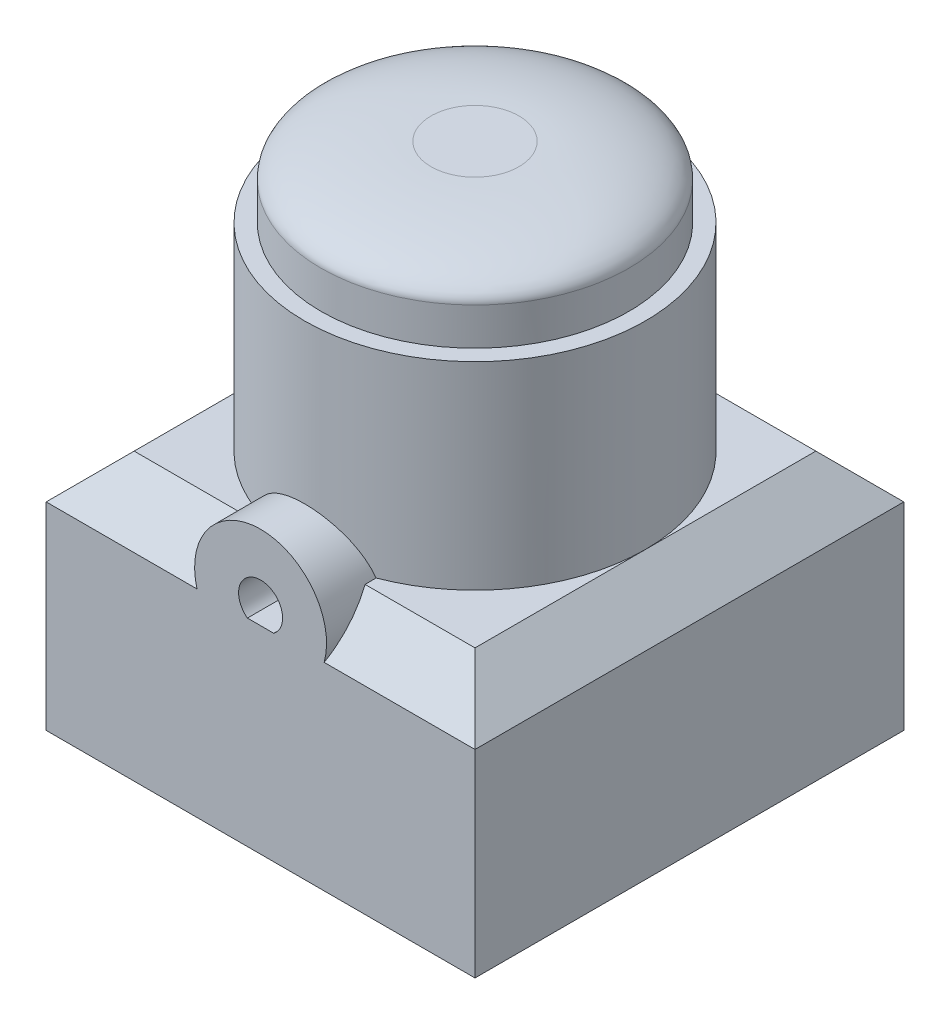
ISO-10303-21;
HEADER;
FILE_DESCRIPTION(('STEP AP214'),'2;1');
FILE_NAME('part.step','',(''),(''),'','','');
FILE_SCHEMA(('AUTOMOTIVE_DESIGN { 1 0 10303 214 1 1 1 1 }'));
ENDSEC;
DATA;
#1=APPLICATION_CONTEXT('core data for automotive mechanical design processes');
#2=APPLICATION_PROTOCOL_DEFINITION('international standard','automotive_design',2000,#1);
#3=PRODUCT_CONTEXT('',#1,'mechanical');
#4=PRODUCT('Part','Part','',(#3));
#5=PRODUCT_RELATED_PRODUCT_CATEGORY('part','',(#4));
#6=PRODUCT_DEFINITION_FORMATION('','',#4);
#7=PRODUCT_DEFINITION_CONTEXT('part definition',#1,'design');
#8=PRODUCT_DEFINITION('design','',#6,#7);
#9=PRODUCT_DEFINITION_SHAPE('','',#8);
#10=(LENGTH_UNIT() NAMED_UNIT(*) SI_UNIT(.MILLI.,.METRE.));
#11=(NAMED_UNIT(*) PLANE_ANGLE_UNIT() SI_UNIT($,.RADIAN.));
#12=(NAMED_UNIT(*) SI_UNIT($,.STERADIAN.) SOLID_ANGLE_UNIT());
#13=UNCERTAINTY_MEASURE_WITH_UNIT(LENGTH_MEASURE(1.E-05),#10,'distance_accuracy_value','');
#14=(GEOMETRIC_REPRESENTATION_CONTEXT(3) GLOBAL_UNCERTAINTY_ASSIGNED_CONTEXT((#13)) GLOBAL_UNIT_ASSIGNED_CONTEXT((#10,
#11,#12)) REPRESENTATION_CONTEXT('',''));
#15=CARTESIAN_POINT('',(0.,0.,0.));
#16=DIRECTION('',(0.,0.,1.));
#17=DIRECTION('',(1.,0.,0.));
#18=AXIS2_PLACEMENT_3D('',#15,#16,#17);
#19=CARTESIAN_POINT('',(0.,11.,7.75));
#20=DIRECTION('',(0.,-0.707106781186546,-0.707106781186549));
#21=DIRECTION('',(1.,0.,0.));
#22=AXIS2_PLACEMENT_3D('',#19,#20,#21);
#23=PLANE('',#22);
#24=CARTESIAN_POINT('',(0.,9.8,8.94999999999999));
#25=DIRECTION('',(0.,-0.707106781186546,-0.707106781186549));
#26=DIRECTION('',(0.,-0.707106781186549,0.707106781186546));
#27=AXIS2_PLACEMENT_3D('',#24,#25,#26);
#28=ELLIPSE('',#27,4.24264068711928,3.);
#29=CARTESIAN_POINT('',(2.7495454169735,11.,7.75));
#30=VERTEX_POINT('',#29);
#31=CARTESIAN_POINT('',(2.89136645896019,8.99999999999999,9.75));
#32=VERTEX_POINT('',#31);
#33=EDGE_CURVE('E295',#30,#32,#28,.T.);
#34=ORIENTED_EDGE('',*,*,#33,.T.);
#35=DIRECTION('',(-1.,0.,0.));
#36=VECTOR('',#35,1.);
#37=CARTESIAN_POINT('',(-9.75,8.99999999999999,9.75));
#38=LINE('',#37,#36);
#39=CARTESIAN_POINT('',(9.75,8.99999999999999,9.75));
#40=VERTEX_POINT('',#39);
#41=EDGE_CURVE('E12',#40,#32,#38,.T.);
#42=ORIENTED_EDGE('',*,*,#41,.F.);
#43=DIRECTION('',(-0.577350269189625,0.577350269189627,-0.577350269189625));
#44=VECTOR('',#43,1.);
#45=CARTESIAN_POINT('',(5.16666666666667,13.5833333333333,5.16666666666667));
#46=LINE('',#45,#44);
#47=CARTESIAN_POINT('',(7.75,11.,7.75));
#48=VERTEX_POINT('',#47);
#49=EDGE_CURVE('E294',#48,#40,#46,.F.);
#50=ORIENTED_EDGE('',*,*,#49,.F.);
#51=DIRECTION('',(1.,0.,0.));
#52=VECTOR('',#51,1.);
#53=CARTESIAN_POINT('',(0.,11.,7.75));
#54=LINE('',#53,#52);
#55=EDGE_CURVE('E262',#30,#48,#54,.T.);
#56=ORIENTED_EDGE('',*,*,#55,.F.);
#57=EDGE_LOOP('',(#34,#42,#50,#56));
#58=FACE_BOUND('',#57,.T.);
#59=ADVANCED_FACE('F38',(#58),#23,.F.);
#60=CARTESIAN_POINT('',(0.,11.,0.));
#61=DIRECTION('',(0.,-1.,0.));
#62=DIRECTION('',(0.,0.,-1.));
#63=AXIS2_PLACEMENT_3D('',#60,#61,#62);
#64=PLANE('',#63);
#65=CARTESIAN_POINT('',(0.,11.,0.));
#66=DIRECTION('',(0.,1.,0.));
#67=DIRECTION('',(0.,0.,1.));
#68=AXIS2_PLACEMENT_3D('',#65,#66,#67);
#69=CIRCLE('',#68,7.75);
#70=CARTESIAN_POINT('',(2.7495454169735,11.,7.24586088743084));
#71=VERTEX_POINT('',#70);
#72=CARTESIAN_POINT('',(7.75,11.,0.));
#73=VERTEX_POINT('',#72);
#74=EDGE_CURVE('E318',#71,#73,#69,.T.);
#75=ORIENTED_EDGE('',*,*,#74,.F.);
#76=DIRECTION('',(0.,0.,1.));
#77=VECTOR('',#76,1.);
#78=CARTESIAN_POINT('',(2.7495454169735,11.,-9.752));
#79=LINE('',#78,#77);
#80=EDGE_CURVE('E158',#30,#71,#79,.F.);
#81=ORIENTED_EDGE('',*,*,#80,.F.);
#82=ORIENTED_EDGE('',*,*,#55,.T.);
#83=DIRECTION('',(0.,0.,-1.));
#84=VECTOR('',#83,1.);
#85=CARTESIAN_POINT('',(7.75,11.,0.));
#86=LINE('',#85,#84);
#87=EDGE_CURVE('E282',#48,#73,#86,.T.);
#88=ORIENTED_EDGE('',*,*,#87,.T.);
#89=EDGE_LOOP('',(#75,#81,#82,#88));
#90=FACE_BOUND('',#89,.T.);
#91=ADVANCED_FACE('F396',(#90),#64,.F.);
#92=CARTESIAN_POINT('',(0.,11.,-7.75));
#93=VERTEX_POINT('',#92);
#94=EDGE_CURVE('E319',#73,#93,#69,.T.);
#95=ORIENTED_EDGE('',*,*,#94,.F.);
#96=DIRECTION('',(0.,0.,-1.));
#97=VECTOR('',#96,1.);
#98=CARTESIAN_POINT('',(7.75,11.,0.));
#99=LINE('',#98,#97);
#100=CARTESIAN_POINT('',(7.75,11.,-7.75));
#101=VERTEX_POINT('',#100);
#102=EDGE_CURVE('E280',#73,#101,#99,.T.);
#103=ORIENTED_EDGE('',*,*,#102,.T.);
#104=DIRECTION('',(-1.,0.,0.));
#105=VECTOR('',#104,1.);
#106=CARTESIAN_POINT('',(0.,11.,-7.75));
#107=LINE('',#106,#105);
#108=EDGE_CURVE('E278',#101,#93,#107,.T.);
#109=ORIENTED_EDGE('',*,*,#108,.T.);
#110=EDGE_LOOP('',(#95,#103,#109));
#111=FACE_BOUND('',#110,.T.);
#112=ADVANCED_FACE('F403',(#111),#64,.F.);
#113=CARTESIAN_POINT('',(-7.75,11.,0.));
#114=VERTEX_POINT('',#113);
#115=EDGE_CURVE('E340',#93,#114,#69,.T.);
#116=ORIENTED_EDGE('',*,*,#115,.F.);
#117=DIRECTION('',(-1.,0.,0.));
#118=VECTOR('',#117,1.);
#119=CARTESIAN_POINT('',(0.,11.,-7.75));
#120=LINE('',#119,#118);
#121=CARTESIAN_POINT('',(-7.75,11.,-7.75));
#122=VERTEX_POINT('',#121);
#123=EDGE_CURVE('E276',#93,#122,#120,.T.);
#124=ORIENTED_EDGE('',*,*,#123,.T.);
#125=DIRECTION('',(0.,0.,1.));
#126=VECTOR('',#125,1.);
#127=CARTESIAN_POINT('',(-7.75,11.,0.));
#128=LINE('',#127,#126);
#129=EDGE_CURVE('E274',#122,#114,#128,.T.);
#130=ORIENTED_EDGE('',*,*,#129,.T.);
#131=EDGE_LOOP('',(#116,#124,#130));
#132=FACE_BOUND('',#131,.T.);
#133=ADVANCED_FACE('F358',(#132),#64,.F.);
#134=CARTESIAN_POINT('',(9.75,11.,9.75));
#135=DIRECTION('',(-1.,0.,0.));
#136=DIRECTION('',(0.,0.,1.));
#137=AXIS2_PLACEMENT_3D('',#134,#135,#136);
#138=PLANE('',#137);
#139=DIRECTION('',(0.,-1.,0.));
#140=VECTOR('',#139,1.);
#141=CARTESIAN_POINT('',(9.75,11.,-9.75));
#142=LINE('',#141,#140);
#143=CARTESIAN_POINT('',(9.75,8.99999999999999,-9.75));
#144=VERTEX_POINT('',#143);
#145=CARTESIAN_POINT('',(9.75,0.,-9.75));
#146=VERTEX_POINT('',#145);
#147=EDGE_CURVE('E335',#144,#146,#142,.T.);
#148=ORIENTED_EDGE('',*,*,#147,.F.);
#149=DIRECTION('',(0.,0.,1.));
#150=VECTOR('',#149,1.);
#151=CARTESIAN_POINT('',(9.75,8.99999999999999,9.75));
#152=LINE('',#151,#150);
#153=EDGE_CURVE('E285',#144,#40,#152,.T.);
#154=ORIENTED_EDGE('',*,*,#153,.T.);
#155=DIRECTION('',(0.,-1.,0.));
#156=VECTOR('',#155,1.);
#157=CARTESIAN_POINT('',(9.75,11.,9.75));
#158=LINE('',#157,#156);
#159=CARTESIAN_POINT('',(9.75,0.,9.75));
#160=VERTEX_POINT('',#159);
#161=EDGE_CURVE('E330',#40,#160,#158,.T.);
#162=ORIENTED_EDGE('',*,*,#161,.T.);
#163=DIRECTION('',(0.,0.,-1.));
#164=VECTOR('',#163,1.);
#165=CARTESIAN_POINT('',(9.75,0.,9.75));
#166=LINE('',#165,#164);
#167=EDGE_CURVE('E308',#160,#146,#166,.T.);
#168=ORIENTED_EDGE('',*,*,#167,.T.);
#169=EDGE_LOOP('',(#148,#154,#162,#168));
#170=FACE_BOUND('',#169,.T.);
#171=ADVANCED_FACE('F232',(#170),#138,.F.);
#172=CARTESIAN_POINT('',(-9.75,11.,-9.75));
#173=DIRECTION('',(0.,0.,1.));
#174=DIRECTION('',(1.,0.,0.));
#175=AXIS2_PLACEMENT_3D('',#172,#173,#174);
#176=PLANE('',#175);
#177=DIRECTION('',(0.,-1.,0.));
#178=VECTOR('',#177,1.);
#179=CARTESIAN_POINT('',(-9.75,11.,-9.75));
#180=LINE('',#179,#178);
#181=CARTESIAN_POINT('',(-9.75,8.99999999999999,-9.75));
#182=VERTEX_POINT('',#181);
#183=CARTESIAN_POINT('',(-9.75,0.,-9.75));
#184=VERTEX_POINT('',#183);
#185=EDGE_CURVE('E334',#182,#184,#180,.T.);
#186=ORIENTED_EDGE('',*,*,#185,.F.);
#187=DIRECTION('',(1.,0.,0.));
#188=VECTOR('',#187,1.);
#189=CARTESIAN_POINT('',(-9.75,8.99999999999999,-9.75));
#190=LINE('',#189,#188);
#191=EDGE_CURVE('E288',#182,#144,#190,.T.);
#192=ORIENTED_EDGE('',*,*,#191,.T.);
#193=ORIENTED_EDGE('',*,*,#147,.T.);
#194=DIRECTION('',(-1.,0.,0.));
#195=VECTOR('',#194,1.);
#196=CARTESIAN_POINT('',(-9.75,0.,-9.75));
#197=LINE('',#196,#195);
#198=EDGE_CURVE('E313',#146,#184,#197,.T.);
#199=ORIENTED_EDGE('',*,*,#198,.T.);
#200=EDGE_LOOP('',(#186,#192,#193,#199));
#201=FACE_BOUND('',#200,.T.);
#202=ADVANCED_FACE('F381',(#201),#176,.F.);
#203=CARTESIAN_POINT('',(-9.75,11.,9.75));
#204=DIRECTION('',(1.,0.,0.));
#205=DIRECTION('',(0.,0.,-1.));
#206=AXIS2_PLACEMENT_3D('',#203,#204,#205);
#207=PLANE('',#206);
#208=DIRECTION('',(0.,-1.,0.));
#209=VECTOR('',#208,1.);
#210=CARTESIAN_POINT('',(-9.75,11.,9.75));
#211=LINE('',#210,#209);
#212=CARTESIAN_POINT('',(-9.75,8.99999999999999,9.75));
#213=VERTEX_POINT('',#212);
#214=CARTESIAN_POINT('',(-9.75,0.,9.75));
#215=VERTEX_POINT('',#214);
#216=EDGE_CURVE('E332',#213,#215,#211,.T.);
#217=ORIENTED_EDGE('',*,*,#216,.F.);
#218=DIRECTION('',(0.,0.,-1.));
#219=VECTOR('',#218,1.);
#220=CARTESIAN_POINT('',(-9.75,8.99999999999999,9.75));
#221=LINE('',#220,#219);
#222=EDGE_CURVE('E63',#213,#182,#221,.T.);
#223=ORIENTED_EDGE('',*,*,#222,.T.);
#224=ORIENTED_EDGE('',*,*,#185,.T.);
#225=DIRECTION('',(0.,0.,1.));
#226=VECTOR('',#225,1.);
#227=CARTESIAN_POINT('',(-9.75,0.,9.75));
#228=LINE('',#227,#226);
#229=EDGE_CURVE('E324',#184,#215,#228,.T.);
#230=ORIENTED_EDGE('',*,*,#229,.T.);
#231=EDGE_LOOP('',(#217,#223,#224,#230));
#232=FACE_BOUND('',#231,.T.);
#233=ADVANCED_FACE('F383',(#232),#207,.F.);
#234=CARTESIAN_POINT('',(-9.75,11.,9.75));
#235=DIRECTION('',(0.,0.,-1.));
#236=DIRECTION('',(-1.,0.,0.));
#237=AXIS2_PLACEMENT_3D('',#234,#235,#236);
#238=PLANE('',#237);
#239=CARTESIAN_POINT('',(0.,9.8,9.75));
#240=DIRECTION('',(0.,0.,1.));
#241=DIRECTION('',(1.,0.,0.));
#242=AXIS2_PLACEMENT_3D('',#239,#240,#241);
#243=CIRCLE('',#242,3.);
#244=CARTESIAN_POINT('',(-2.89136645896019,8.99999999999999,9.75));
#245=VERTEX_POINT('',#244);
#246=EDGE_CURVE('E153',#32,#245,#243,.T.);
#247=ORIENTED_EDGE('',*,*,#246,.T.);
#248=EDGE_CURVE('E50',#245,#213,#38,.T.);
#249=ORIENTED_EDGE('',*,*,#248,.T.);
#250=ORIENTED_EDGE('',*,*,#216,.T.);
#251=DIRECTION('',(1.,0.,0.));
#252=VECTOR('',#251,1.);
#253=CARTESIAN_POINT('',(-9.75,0.,9.75));
#254=LINE('',#253,#252);
#255=EDGE_CURVE('E327',#215,#160,#254,.T.);
#256=ORIENTED_EDGE('',*,*,#255,.T.);
#257=ORIENTED_EDGE('',*,*,#161,.F.);
#258=ORIENTED_EDGE('',*,*,#41,.T.);
#259=EDGE_LOOP('',(#247,#249,#250,#256,#257,#258));
#260=FACE_BOUND('',#259,.T.);
#261=CARTESIAN_POINT('',(0.599999999999993,8.99999999999999,9.75));
#262=VERTEX_POINT('',#261);
#263=CARTESIAN_POINT('',(-0.599999999999993,8.99999999999999,9.75));
#264=VERTEX_POINT('',#263);
#265=EDGE_CURVE('E48',#262,#264,#38,.T.);
#266=ORIENTED_EDGE('',*,*,#265,.T.);
#267=CARTESIAN_POINT('',(0.,9.8,9.75));
#268=DIRECTION('',(0.,0.,1.));
#269=DIRECTION('',(1.,0.,0.));
#270=AXIS2_PLACEMENT_3D('',#267,#268,#269);
#271=CIRCLE('',#270,1.);
#272=EDGE_CURVE('E156',#262,#264,#271,.T.);
#273=ORIENTED_EDGE('',*,*,#272,.F.);
#274=EDGE_LOOP('',(#266,#273));
#275=FACE_BOUND('',#274,.T.);
#276=ADVANCED_FACE('F373',(#260,#275),#238,.F.);
#277=DIRECTION('',(1.,0.,0.));
#278=VECTOR('',#277,1.);
#279=CARTESIAN_POINT('',(0.,11.,7.75));
#280=LINE('',#279,#278);
#281=CARTESIAN_POINT('',(-7.75,11.,7.75));
#282=VERTEX_POINT('',#281);
#283=CARTESIAN_POINT('',(-2.7495454169735,11.,7.75));
#284=VERTEX_POINT('',#283);
#285=EDGE_CURVE('E269',#282,#284,#280,.T.);
#286=ORIENTED_EDGE('',*,*,#285,.T.);
#287=DIRECTION('',(0.,0.,1.));
#288=VECTOR('',#287,1.);
#289=CARTESIAN_POINT('',(-2.7495454169735,11.,-9.752));
#290=LINE('',#289,#288);
#291=CARTESIAN_POINT('',(-2.7495454169735,11.,7.24586088743084));
#292=VERTEX_POINT('',#291);
#293=EDGE_CURVE('E168',#292,#284,#290,.T.);
#294=ORIENTED_EDGE('',*,*,#293,.F.);
#295=EDGE_CURVE('E320',#114,#292,#69,.T.);
#296=ORIENTED_EDGE('',*,*,#295,.F.);
#297=DIRECTION('',(0.,0.,1.));
#298=VECTOR('',#297,1.);
#299=CARTESIAN_POINT('',(-7.75,11.,0.));
#300=LINE('',#299,#298);
#301=EDGE_CURVE('E272',#114,#282,#300,.T.);
#302=ORIENTED_EDGE('',*,*,#301,.T.);
#303=EDGE_LOOP('',(#286,#294,#296,#302));
#304=FACE_BOUND('',#303,.T.);
#305=ADVANCED_FACE('F361',(#304),#64,.F.);
#306=CARTESIAN_POINT('',(0.,0.,0.));
#307=DIRECTION('',(0.,-1.,0.));
#308=DIRECTION('',(0.,0.,-1.));
#309=AXIS2_PLACEMENT_3D('',#306,#307,#308);
#310=PLANE('',#309);
#311=ORIENTED_EDGE('',*,*,#167,.F.);
#312=ORIENTED_EDGE('',*,*,#255,.F.);
#313=ORIENTED_EDGE('',*,*,#229,.F.);
#314=ORIENTED_EDGE('',*,*,#198,.F.);
#315=EDGE_LOOP('',(#311,#312,#313,#314));
#316=FACE_BOUND('',#315,.T.);
#317=ADVANCED_FACE('F385',(#316),#310,.T.);
#318=CARTESIAN_POINT('',(0.,20.,0.));
#319=DIRECTION('',(0.,-1.,0.));
#320=DIRECTION('',(0.,0.,-1.));
#321=AXIS2_PLACEMENT_3D('',#318,#319,#320);
#322=CYLINDRICAL_SURFACE('',#321,7.75);
#323=CARTESIAN_POINT('',(0.,20.,0.));
#324=DIRECTION('',(0.,1.,0.));
#325=DIRECTION('',(0.,0.,1.));
#326=AXIS2_PLACEMENT_3D('',#323,#324,#325);
#327=CIRCLE('',#326,7.75);
#328=CARTESIAN_POINT('',(0.,20.,7.75));
#329=VERTEX_POINT('',#328);
#330=EDGE_CURVE('E303',#329,#329,#327,.T.);
#331=ORIENTED_EDGE('',*,*,#330,.F.);
#332=EDGE_LOOP('',(#331));
#333=FACE_BOUND('',#332,.T.);
#334=ORIENTED_EDGE('',*,*,#295,.T.);
#335=CARTESIAN_POINT('',(2.7495454169735,11.,7.24586088743084));
#336=CARTESIAN_POINT('',(2.71520259415597,11.0786835269217,7.25888828008076));
#337=CARTESIAN_POINT('',(2.67756631133697,11.1557081558871,7.27289504486675));
#338=CARTESIAN_POINT('',(2.59600063592866,11.3060206308308,7.30240912504305));
#339=CARTESIAN_POINT('',(2.55207309474803,11.3793095675856,7.31791599854309));
#340=CARTESIAN_POINT('',(2.41136107624834,11.5928605112872,7.36597816988511));
#341=CARTESIAN_POINT('',(2.30557261073228,11.7269764388376,7.40010479276824));
#342=CARTESIAN_POINT('',(2.07300003297264,11.9752304762138,7.46859056424431));
#343=CARTESIAN_POINT('',(1.94622537987906,12.0893775391893,7.50294960141876));
#344=CARTESIAN_POINT('',(1.67459118970335,12.2949392750235,7.56820454770555));
#345=CARTESIAN_POINT('',(1.52973410741772,12.3863570284898,7.59910092581587));
#346=CARTESIAN_POINT('',(1.22530816240891,12.5437219692207,7.6540870052765));
#347=CARTESIAN_POINT('',(1.06572080778775,12.609636586914,7.67816799235652));
#348=CARTESIAN_POINT('',(0.736541029420998,12.7132868183834,7.71669648673464));
#349=CARTESIAN_POINT('',(0.566952974885072,12.7510346409772,7.73114816753722));
#350=CARTESIAN_POINT('',(0.233606214587498,12.7953266445899,7.74816738043278));
#351=CARTESIAN_POINT('',(0.0701118624461486,12.8036137389385,7.75139844187439));
#352=CARTESIAN_POINT('',(-0.255904046054869,12.7935090102511,7.74748801072216));
#353=CARTESIAN_POINT('',(-0.418425778435424,12.7751221707715,7.74034845569562));
#354=CARTESIAN_POINT('',(-0.732353720126233,12.7134883586009,7.71687418766111));
#355=CARTESIAN_POINT('',(-0.883949722031815,12.6710796242327,7.70084988559763));
#356=CARTESIAN_POINT('',(-1.17782036675758,12.5635547122244,7.66141245134711));
#357=CARTESIAN_POINT('',(-1.32009344806733,12.4984347421334,7.63799808518735));
#358=CARTESIAN_POINT('',(-1.59734971334692,12.3445187662467,7.58496335178934));
#359=CARTESIAN_POINT('',(-1.73183941758067,12.2549057809033,7.55513829326483));
#360=CARTESIAN_POINT('',(-1.98437116937351,12.0556970352512,7.49277780514603));
#361=CARTESIAN_POINT('',(-2.10240852697419,11.9460955974407,7.46024160691176));
#362=CARTESIAN_POINT('',(-2.32236145197088,11.7062402381208,7.39477167215863));
#363=CARTESIAN_POINT('',(-2.42378428416192,11.5755276388581,7.3618492341843));
#364=CARTESIAN_POINT('',(-2.5590057914314,11.3679089631969,7.31548178666419));
#365=CARTESIAN_POINT('',(-2.60128091940835,11.2967320439179,7.30052068105428));
#366=CARTESIAN_POINT('',(-2.67991716615507,11.1508892050764,7.27202016725805));
#367=CARTESIAN_POINT('',(-2.71627679585887,11.0762224131036,7.25848111733863));
#368=CARTESIAN_POINT('',(-2.7495454169735,11.,7.24586088743084));
#369=B_SPLINE_CURVE_WITH_KNOTS('',3,(#335,#336,#337,#338,#339,#340,#341,#342,#343,#344,#345,
#346,#347,#348,#349,#350,#351,#352,#353,#354,#355,#356,#357,#358,#359,#360,#361,#362,#363,#364,
#365,#366,#367,#368),.UNSPECIFIED.,.F.,.F.,(4,2,2,2,2,2,2,2,2,2,2,2,2,2,2,2,4),(0.,
0.260320488265954,0.520564525522831,1.04049643753883,1.56019463443566,2.07982235580604,
2.60011151061048,3.12017501634224,3.60890623954887,4.09754616366518,4.57010162774997,
5.04273603963785,5.53361694597101,6.02463749943929,6.52828707669633,6.78041165772617,
7.03259960640104),.UNSPECIFIED.);
#370=EDGE_CURVE('E160',#71,#292,#369,.T.);
#371=ORIENTED_EDGE('',*,*,#370,.F.);
#372=ORIENTED_EDGE('',*,*,#74,.T.);
#373=ORIENTED_EDGE('',*,*,#94,.T.);
#374=ORIENTED_EDGE('',*,*,#115,.T.);
#375=EDGE_LOOP('',(#334,#371,#372,#373,#374));
#376=FACE_BOUND('',#375,.T.);
#377=ADVANCED_FACE('F349',(#333,#376),#322,.T.);
#378=CARTESIAN_POINT('',(0.,20.,0.));
#379=DIRECTION('',(0.,1.,0.));
#380=DIRECTION('',(0.,0.,1.));
#381=AXIS2_PLACEMENT_3D('',#378,#379,#380);
#382=PLANE('',#381);
#383=CARTESIAN_POINT('',(0.,20.,0.));
#384=DIRECTION('',(0.,1.,0.));
#385=DIRECTION('',(0.,0.,1.));
#386=AXIS2_PLACEMENT_3D('',#383,#384,#385);
#387=CIRCLE('',#386,7.);
#388=CARTESIAN_POINT('',(0.,20.,7.));
#389=VERTEX_POINT('',#388);
#390=EDGE_CURVE('E317',#389,#389,#387,.T.);
#391=ORIENTED_EDGE('',*,*,#390,.F.);
#392=EDGE_LOOP('',(#391));
#393=FACE_BOUND('',#392,.T.);
#394=ORIENTED_EDGE('',*,*,#330,.T.);
#395=EDGE_LOOP('',(#394));
#396=FACE_BOUND('',#395,.T.);
#397=ADVANCED_FACE('F392',(#393,#396),#382,.T.);
#398=CARTESIAN_POINT('',(0.,23.2,0.));
#399=DIRECTION('',(0.,-1.,0.));
#400=DIRECTION('',(0.,0.,-1.));
#401=AXIS2_PLACEMENT_3D('',#398,#399,#400);
#402=CYLINDRICAL_SURFACE('',#401,7.);
#403=CARTESIAN_POINT('',(0.,21.7,7.));
#404=CARTESIAN_POINT('',(0.916297819117917,21.7,7.));
#405=CARTESIAN_POINT('',(1.83223522578778,21.7,6.81780872206773));
#406=CARTESIAN_POINT('',(3.52533282732348,21.7,6.11650473309028));
#407=CARTESIAN_POINT('',(4.30182706682109,21.7,5.59766786979057));
#408=CARTESIAN_POINT('',(5.59766786979057,21.7,4.30182706682109));
#409=CARTESIAN_POINT('',(6.11650473309028,21.7,3.52533282732349));
#410=CARTESIAN_POINT('',(6.81780872206774,21.7,1.83223522578776));
#411=CARTESIAN_POINT('',(7.,21.7,0.916297819117947));
#412=CARTESIAN_POINT('',(7.,21.7,-0.916297819117946));
#413=CARTESIAN_POINT('',(6.81780872206775,21.7,-1.83223522578773));
#414=CARTESIAN_POINT('',(6.11650473309026,21.7,-3.52533282732353));
#415=CARTESIAN_POINT('',(5.59766786979057,21.7,-4.3018270668211));
#416=CARTESIAN_POINT('',(4.30182706682109,21.7,-5.59766786979057));
#417=CARTESIAN_POINT('',(3.52533282732346,21.7,-6.11650473309029));
#418=CARTESIAN_POINT('',(1.83223522578782,21.7,-6.81780872206772));
#419=CARTESIAN_POINT('',(0.916297819117947,21.7,-7.));
#420=CARTESIAN_POINT('',(-0.916297819117945,21.7,-7.));
#421=CARTESIAN_POINT('',(-1.8322352257878,21.7,-6.81780872206772));
#422=CARTESIAN_POINT('',(-3.52533282732344,21.7,-6.1165047330903));
#423=CARTESIAN_POINT('',(-4.30182706682104,21.7,-5.59766786979062));
#424=CARTESIAN_POINT('',(-5.59766786979063,21.7,-4.30182706682104));
#425=CARTESIAN_POINT('',(-6.11650473309027,21.7,-3.5253328273235));
#426=CARTESIAN_POINT('',(-6.81780872206773,21.7,-1.83223522578777));
#427=CARTESIAN_POINT('',(-7.,21.7,-0.916297819117936));
#428=CARTESIAN_POINT('',(-7.,21.7,0.916297819117958));
#429=CARTESIAN_POINT('',(-6.81780872206773,21.7,1.83223522578776));
#430=CARTESIAN_POINT('',(-6.11650473309029,21.7,3.52533282732347));
#431=CARTESIAN_POINT('',(-5.59766786979059,21.7,4.30182706682107));
#432=CARTESIAN_POINT('',(-4.30182706682111,21.7,5.59766786979056));
#433=CARTESIAN_POINT('',(-3.52533282732345,21.7,6.11650473309029));
#434=CARTESIAN_POINT('',(-1.83223522578782,21.7,6.81780872206771));
#435=CARTESIAN_POINT('',(-0.916297819117918,21.7,7.));
#436=CARTESIAN_POINT('',(0.,21.7,7.));
#437=(BOUNDED_CURVE() B_SPLINE_CURVE(3,(#403,#404,#405,#406,#407,#408,#409,#410,#411,#412,#413,
#414,#415,#416,#417,#418,#419,#420,#421,#422,#423,#424,#425,#426,#427,#428,#429,#430,#431,#432,
#433,#434,#435,#436),.UNSPECIFIED.,.T.,.F.) B_SPLINE_CURVE_WITH_KNOTS((4,2,2,2,2,2,2,2,2,2,2,2,
2,2,2,2,4),(0.,0.392699081698724,0.785398163397448,1.17809724509617,1.5707963267949,
1.96349540849362,2.35619449019234,2.74889357189107,3.14159265358979,3.53429173528852,
3.92699081698724,4.31968989868597,4.71238898038469,5.10508806208341,5.49778714378214,
5.89048622548086,6.28318530717959),
.UNSPECIFIED.) CURVE() GEOMETRIC_REPRESENTATION_ITEM() RATIONAL_B_SPLINE_CURVE((1.,1.,1.,1.,1.,
1.,1.,1.,1.,1.,1.,1.,1.,1.,1.,1.,1.,1.,1.,1.,1.,1.,1.,1.,1.,1.,1.,1.,1.,1.,1.,1.,1.,1.)) REPRESENTATION_ITEM(''));
#438=CARTESIAN_POINT('',(0.,21.7,7.));
#439=VERTEX_POINT('',#438);
#440=EDGE_CURVE('E200',#439,#439,#437,.F.);
#441=ORIENTED_EDGE('',*,*,#440,.T.);
#442=EDGE_LOOP('',(#441));
#443=FACE_BOUND('',#442,.T.);
#444=ORIENTED_EDGE('',*,*,#390,.T.);
#445=EDGE_LOOP('',(#444));
#446=FACE_BOUND('',#445,.T.);
#447=ADVANCED_FACE('F180',(#443,#446),#402,.T.);
#448=CARTESIAN_POINT('',(0.,23.2,0.));
#449=DIRECTION('',(0.,1.,0.));
#450=DIRECTION('',(0.,0.,1.));
#451=AXIS2_PLACEMENT_3D('',#448,#449,#450);
#452=PLANE('',#451);
#453=CARTESIAN_POINT('',(0.,23.2,2.));
#454=CARTESIAN_POINT('',(-0.261799376890834,23.2,2.));
#455=CARTESIAN_POINT('',(-0.52349577879652,23.2,1.94794534916221));
#456=CARTESIAN_POINT('',(-1.00723795066384,23.2,1.74757278088294));
#457=CARTESIAN_POINT('',(-1.22909344766319,23.2,1.599333677083));
#458=CARTESIAN_POINT('',(-1.59933367708301,23.2,1.22909344766318));
#459=CARTESIAN_POINT('',(-1.74757278088294,23.2,1.00723795066384));
#460=CARTESIAN_POINT('',(-1.94794534916221,23.2,0.523495778796514));
#461=CARTESIAN_POINT('',(-2.,23.2,0.261799376890845));
#462=CARTESIAN_POINT('',(-2.,23.2,-0.261799376890839));
#463=CARTESIAN_POINT('',(-1.94794534916221,23.2,-0.523495778796506));
#464=CARTESIAN_POINT('',(-1.74757278088294,23.2,-1.00723795066386));
#465=CARTESIAN_POINT('',(-1.59933367708304,23.2,-1.22909344766315));
#466=CARTESIAN_POINT('',(-1.22909344766315,23.2,-1.59933367708304));
#467=CARTESIAN_POINT('',(-1.00723795066384,23.2,-1.74757278088292));
#468=CARTESIAN_POINT('',(-0.523495778796517,23.2,-1.94794534916223));
#469=CARTESIAN_POINT('',(-0.261799376890842,23.2,-2.));
#470=CARTESIAN_POINT('',(0.261799376890842,23.2,-2.));
#471=CARTESIAN_POINT('',(0.523495778796522,23.2,-1.9479453491622));
#472=CARTESIAN_POINT('',(1.00723795066384,23.2,-1.74757278088294));
#473=CARTESIAN_POINT('',(1.22909344766318,23.2,-1.59933367708301));
#474=CARTESIAN_POINT('',(1.59933367708301,23.2,-1.22909344766318));
#475=CARTESIAN_POINT('',(1.7475727808829,23.2,-1.00723795066382));
#476=CARTESIAN_POINT('',(1.94794534916225,23.2,-0.52349577879654));
#477=CARTESIAN_POINT('',(2.,23.2,-0.261799376890842));
#478=CARTESIAN_POINT('',(2.,23.2,0.261799376890842));
#479=CARTESIAN_POINT('',(1.94794534916222,23.2,0.52349577879651));
#480=CARTESIAN_POINT('',(1.74757278088293,23.2,1.00723795066385));
#481=CARTESIAN_POINT('',(1.59933367708304,23.2,1.22909344766315));
#482=CARTESIAN_POINT('',(1.22909344766315,23.2,1.59933367708304));
#483=CARTESIAN_POINT('',(1.00723795066382,23.2,1.74757278088291));
#484=CARTESIAN_POINT('',(0.523495778796538,23.2,1.94794534916224));
#485=CARTESIAN_POINT('',(0.261799376890833,23.2,2.));
#486=CARTESIAN_POINT('',(0.,23.2,2.));
#487=(BOUNDED_CURVE() B_SPLINE_CURVE(3,(#453,#454,#455,#456,#457,#458,#459,#460,#461,#462,#463,
#464,#465,#466,#467,#468,#469,#470,#471,#472,#473,#474,#475,#476,#477,#478,#479,#480,#481,#482,
#483,#484,#485,#486),.UNSPECIFIED.,.T.,.F.) B_SPLINE_CURVE_WITH_KNOTS((4,2,2,2,2,2,2,2,2,2,2,2,
2,2,2,2,4),(0.,0.392699081698725,0.785398163397448,1.17809724509617,1.5707963267949,
1.96349540849362,2.35619449019234,2.74889357189107,3.14159265358979,3.53429173528852,
3.92699081698724,4.31968989868597,4.71238898038469,5.10508806208341,5.49778714378214,
5.89048622548086,6.28318530717959),
.UNSPECIFIED.) CURVE() GEOMETRIC_REPRESENTATION_ITEM() RATIONAL_B_SPLINE_CURVE((1.,1.,1.,1.,1.,
1.,1.,1.,1.,1.,1.,1.,1.,1.,1.,1.,1.,1.,1.,1.,1.,1.,1.,1.,1.,1.,1.,1.,1.,1.,1.,1.,1.,1.)) REPRESENTATION_ITEM(''));
#488=CARTESIAN_POINT('',(0.,23.2,2.));
#489=VERTEX_POINT('',#488);
#490=EDGE_CURVE('E212',#489,#489,#487,.F.);
#491=ORIENTED_EDGE('',*,*,#490,.T.);
#492=EDGE_LOOP('',(#491));
#493=FACE_BOUND('',#492,.T.);
#494=ADVANCED_FACE('F175',(#493),#452,.T.);
#495=CARTESIAN_POINT('',(0.,23.2,2.));
#496=CARTESIAN_POINT('',(0.261799376890833,23.2,2.));
#497=CARTESIAN_POINT('',(0.523495778796538,23.2,1.94794534916224));
#498=CARTESIAN_POINT('',(1.00723795066382,23.2,1.74757278088291));
#499=CARTESIAN_POINT('',(1.22909344766315,23.2,1.59933367708304));
#500=CARTESIAN_POINT('',(1.59933367708304,23.2,1.22909344766315));
#501=CARTESIAN_POINT('',(1.74757278088293,23.2,1.00723795066385));
#502=CARTESIAN_POINT('',(1.94794534916222,23.2,0.52349577879651));
#503=CARTESIAN_POINT('',(2.,23.2,0.261799376890842));
#504=CARTESIAN_POINT('',(2.,23.2,-0.261799376890842));
#505=CARTESIAN_POINT('',(1.94794534916225,23.2,-0.52349577879654));
#506=CARTESIAN_POINT('',(1.7475727808829,23.2,-1.00723795066382));
#507=CARTESIAN_POINT('',(1.59933367708301,23.2,-1.22909344766318));
#508=CARTESIAN_POINT('',(1.22909344766318,23.2,-1.59933367708301));
#509=CARTESIAN_POINT('',(1.00723795066384,23.2,-1.74757278088294));
#510=CARTESIAN_POINT('',(0.523495778796522,23.2,-1.9479453491622));
#511=CARTESIAN_POINT('',(0.261799376890842,23.2,-2.));
#512=CARTESIAN_POINT('',(-0.261799376890842,23.2,-2.));
#513=CARTESIAN_POINT('',(-0.523495778796517,23.2,-1.94794534916223));
#514=CARTESIAN_POINT('',(-1.00723795066384,23.2,-1.74757278088292));
#515=CARTESIAN_POINT('',(-1.22909344766315,23.2,-1.59933367708304));
#516=CARTESIAN_POINT('',(-1.59933367708304,23.2,-1.22909344766315));
#517=CARTESIAN_POINT('',(-1.74757278088294,23.2,-1.00723795066386));
#518=CARTESIAN_POINT('',(-1.94794534916221,23.2,-0.523495778796506));
#519=CARTESIAN_POINT('',(-2.,23.2,-0.261799376890839));
#520=CARTESIAN_POINT('',(-2.,23.2,0.261799376890845));
#521=CARTESIAN_POINT('',(-1.94794534916221,23.2,0.523495778796514));
#522=CARTESIAN_POINT('',(-1.74757278088294,23.2,1.00723795066384));
#523=CARTESIAN_POINT('',(-1.59933367708301,23.2,1.22909344766318));
#524=CARTESIAN_POINT('',(-1.22909344766319,23.2,1.599333677083));
#525=CARTESIAN_POINT('',(-1.00723795066384,23.2,1.74757278088294));
#526=CARTESIAN_POINT('',(-0.52349577879652,23.2,1.94794534916221));
#527=CARTESIAN_POINT('',(-0.261799376890834,23.2,2.));
#528=CARTESIAN_POINT('',(0.,23.2,2.));
#529=CARTESIAN_POINT('',(0.,23.2,7.));
#530=CARTESIAN_POINT('',(0.916297819117917,23.2,7.));
#531=CARTESIAN_POINT('',(1.83223522578793,23.2,6.81780872206784));
#532=CARTESIAN_POINT('',(3.52533282732333,23.2,6.11650473309017));
#533=CARTESIAN_POINT('',(4.30182706682115,23.2,5.59766786979063));
#534=CARTESIAN_POINT('',(5.59766786979052,23.2,4.30182706682104));
#535=CARTESIAN_POINT('',(6.11650473309025,23.2,3.52533282732354));
#536=CARTESIAN_POINT('',(6.81780872206777,23.2,1.83223522578772));
#537=CARTESIAN_POINT('',(7.,23.2,0.916297819117947));
#538=CARTESIAN_POINT('',(7.,23.2,-0.916297819117946));
#539=CARTESIAN_POINT('',(6.81780872206788,23.2,-1.83223522578772));
#540=CARTESIAN_POINT('',(6.11650473309013,23.2,-3.52533282732354));
#541=CARTESIAN_POINT('',(5.59766786979045,23.2,-4.30182706682099));
#542=CARTESIAN_POINT('',(4.30182706682121,23.2,-5.59766786979069));
#543=CARTESIAN_POINT('',(3.52533282732346,23.2,-6.11650473309028));
#544=CARTESIAN_POINT('',(1.83223522578782,23.2,-6.81780872206772));
#545=CARTESIAN_POINT('',(0.916297819117947,23.2,-7.));
#546=CARTESIAN_POINT('',(-0.916297819117945,23.2,-7.));
#547=CARTESIAN_POINT('',(-1.83223522578774,23.2,-6.81780872206773));
#548=CARTESIAN_POINT('',(-3.52533282732349,23.2,-6.11650473309029));
#549=CARTESIAN_POINT('',(-4.30182706682121,23.2,-5.59766786979068));
#550=CARTESIAN_POINT('',(-5.59766786979046,23.2,-4.30182706682098));
#551=CARTESIAN_POINT('',(-6.1165047330902,23.2,-3.52533282732358));
#552=CARTESIAN_POINT('',(-6.81780872206781,23.2,-1.83223522578769));
#553=CARTESIAN_POINT('',(-7.,23.2,-0.916297819117936));
#554=CARTESIAN_POINT('',(-7.,23.2,0.916297819117958));
#555=CARTESIAN_POINT('',(-6.81780872206793,23.2,1.8322352257879));
#556=CARTESIAN_POINT('',(-6.11650473309009,23.2,3.52533282732334));
#557=CARTESIAN_POINT('',(-5.59766786979059,23.2,4.30182706682108));
#558=CARTESIAN_POINT('',(-4.3018270668211,23.2,5.59766786979056));
#559=CARTESIAN_POINT('',(-3.52533282732341,23.2,6.1165047330902));
#560=CARTESIAN_POINT('',(-1.83223522578786,23.2,6.81780872206781));
#561=CARTESIAN_POINT('',(-0.916297819117917,23.2,7.));
#562=CARTESIAN_POINT('',(0.,23.2,7.));
#563=CARTESIAN_POINT('',(0.,21.7,7.));
#564=CARTESIAN_POINT('',(0.916297819117917,21.7,7.));
#565=CARTESIAN_POINT('',(1.83223522578778,21.7,6.81780872206773));
#566=CARTESIAN_POINT('',(3.52533282732348,21.7,6.11650473309028));
#567=CARTESIAN_POINT('',(4.30182706682109,21.7,5.59766786979057));
#568=CARTESIAN_POINT('',(5.59766786979057,21.7,4.30182706682109));
#569=CARTESIAN_POINT('',(6.11650473309028,21.7,3.52533282732349));
#570=CARTESIAN_POINT('',(6.81780872206774,21.7,1.83223522578776));
#571=CARTESIAN_POINT('',(7.,21.7,0.916297819117947));
#572=CARTESIAN_POINT('',(7.,21.7,-0.916297819117946));
#573=CARTESIAN_POINT('',(6.81780872206775,21.7,-1.83223522578773));
#574=CARTESIAN_POINT('',(6.11650473309026,21.7,-3.52533282732353));
#575=CARTESIAN_POINT('',(5.59766786979057,21.7,-4.3018270668211));
#576=CARTESIAN_POINT('',(4.30182706682109,21.7,-5.59766786979057));
#577=CARTESIAN_POINT('',(3.52533282732346,21.7,-6.11650473309029));
#578=CARTESIAN_POINT('',(1.83223522578782,21.7,-6.81780872206772));
#579=CARTESIAN_POINT('',(0.916297819117947,21.7,-7.));
#580=CARTESIAN_POINT('',(-0.916297819117945,21.7,-7.));
#581=CARTESIAN_POINT('',(-1.8322352257878,21.7,-6.81780872206772));
#582=CARTESIAN_POINT('',(-3.52533282732344,21.7,-6.1165047330903));
#583=CARTESIAN_POINT('',(-4.30182706682104,21.7,-5.59766786979062));
#584=CARTESIAN_POINT('',(-5.59766786979063,21.7,-4.30182706682104));
#585=CARTESIAN_POINT('',(-6.11650473309027,21.7,-3.5253328273235));
#586=CARTESIAN_POINT('',(-6.81780872206773,21.7,-1.83223522578777));
#587=CARTESIAN_POINT('',(-7.,21.7,-0.916297819117936));
#588=CARTESIAN_POINT('',(-7.,21.7,0.916297819117958));
#589=CARTESIAN_POINT('',(-6.81780872206773,21.7,1.83223522578776));
#590=CARTESIAN_POINT('',(-6.11650473309029,21.7,3.52533282732347));
#591=CARTESIAN_POINT('',(-5.59766786979059,21.7,4.30182706682107));
#592=CARTESIAN_POINT('',(-4.30182706682111,21.7,5.59766786979056));
#593=CARTESIAN_POINT('',(-3.52533282732345,21.7,6.11650473309029));
#594=CARTESIAN_POINT('',(-1.83223522578782,21.7,6.81780872206771));
#595=CARTESIAN_POINT('',(-0.916297819117918,21.7,7.));
#596=CARTESIAN_POINT('',(0.,21.7,7.));
#597=(BOUNDED_SURFACE() B_SPLINE_SURFACE(2,3,((#495,#496,#497,#498,#499,#500,#501,#502,#503,
#504,#505,#506,#507,#508,#509,#510,#511,#512,#513,#514,#515,#516,#517,#518,#519,#520,#521,#522,
#523,#524,#525,#526,#527,#528),(#529,#530,#531,#532,#533,#534,#535,#536,#537,#538,#539,#540,
#541,#542,#543,#544,#545,#546,#547,#548,#549,#550,#551,#552,#553,#554,#555,#556,#557,#558,#559,
#560,#561,#562),(#563,#564,#565,#566,#567,#568,#569,#570,#571,#572,#573,#574,#575,#576,#577,
#578,#579,#580,#581,#582,#583,#584,#585,#586,#587,#588,#589,#590,#591,#592,#593,#594,#595,
#596)),.UNSPECIFIED.,.F.,.T.,.F.) B_SPLINE_SURFACE_WITH_KNOTS((3,3),(4,2,2,2,2,2,2,2,2,2,2,2,2,
2,2,2,4),(0.,1.),(0.,0.392699081698724,0.785398163397448,1.17809724509617,1.5707963267949,
1.96349540849362,2.35619449019234,2.74889357189107,3.14159265358979,3.53429173528852,
3.92699081698724,4.31968989868597,4.71238898038469,5.10508806208341,5.49778714378214,
5.89048622548086,6.28318530717959),
.UNSPECIFIED.) GEOMETRIC_REPRESENTATION_ITEM() RATIONAL_B_SPLINE_SURFACE(((1.,1.,1.,1.,1.,1.,1.,
1.,1.,1.,1.,1.,1.,1.,1.,1.,1.,1.,1.,1.,1.,1.,1.,1.,1.,1.,1.,1.,1.,1.,1.,1.,1.,1.),
(0.707106781186548,0.707106781186548,0.707106781186548,0.707106781186548,0.707106781186548,
0.707106781186548,0.707106781186548,0.707106781186548,0.707106781186548,0.707106781186548,
0.707106781186548,0.707106781186548,0.707106781186548,0.707106781186548,0.707106781186548,
0.707106781186548,0.707106781186548,0.707106781186548,0.707106781186548,0.707106781186548,
0.707106781186548,0.707106781186548,0.707106781186548,0.707106781186548,0.707106781186548,
0.707106781186548,0.707106781186548,0.707106781186548,0.707106781186547,0.707106781186547,
0.707106781186548,0.707106781186548,0.707106781186548,0.707106781186548),(1.,1.,1.,1.,1.,1.,1.,
1.,1.,1.,1.,1.,1.,1.,1.,1.,1.,1.,1.,1.,1.,1.,1.,1.,1.,1.,1.,1.,1.,1.,1.,1.,1.,1.))) REPRESENTATION_ITEM('') SURFACE());
#598=ORIENTED_EDGE('',*,*,#440,.F.);
#599=EDGE_LOOP('',(#598));
#600=FACE_BOUND('',#599,.T.);
#601=ORIENTED_EDGE('',*,*,#490,.F.);
#602=EDGE_LOOP('',(#601));
#603=FACE_BOUND('',#602,.T.);
#604=ADVANCED_FACE('F179',(#600,#603),#597,.T.);
#605=CARTESIAN_POINT('',(-7.75,11.,0.));
#606=DIRECTION('',(0.707106781186549,-0.707106781186546,0.));
#607=DIRECTION('',(0.,0.,1.));
#608=AXIS2_PLACEMENT_3D('',#605,#606,#607);
#609=PLANE('',#608);
#610=DIRECTION('',(-0.577350269189625,-0.577350269189627,-0.577350269189625));
#611=VECTOR('',#610,1.);
#612=CARTESIAN_POINT('',(-5.16666666666667,13.5833333333333,-5.16666666666667));
#613=LINE('',#612,#611);
#614=EDGE_CURVE('E296',#182,#122,#613,.F.);
#615=ORIENTED_EDGE('',*,*,#614,.F.);
#616=ORIENTED_EDGE('',*,*,#222,.F.);
#617=DIRECTION('',(-0.577350269189625,-0.577350269189627,0.577350269189625));
#618=VECTOR('',#617,1.);
#619=CARTESIAN_POINT('',(-5.16666666666667,13.5833333333333,5.16666666666667));
#620=LINE('',#619,#618);
#621=EDGE_CURVE('E43',#282,#213,#620,.T.);
#622=ORIENTED_EDGE('',*,*,#621,.F.);
#623=ORIENTED_EDGE('',*,*,#301,.F.);
#624=ORIENTED_EDGE('',*,*,#129,.F.);
#625=EDGE_LOOP('',(#615,#616,#622,#623,#624));
#626=FACE_BOUND('',#625,.T.);
#627=ADVANCED_FACE('F41',(#626),#609,.F.);
#628=EDGE_CURVE('E365',#245,#284,#28,.T.);
#629=ORIENTED_EDGE('',*,*,#628,.T.);
#630=ORIENTED_EDGE('',*,*,#285,.F.);
#631=ORIENTED_EDGE('',*,*,#621,.T.);
#632=ORIENTED_EDGE('',*,*,#248,.F.);
#633=EDGE_LOOP('',(#629,#630,#631,#632));
#634=FACE_BOUND('',#633,.T.);
#635=ADVANCED_FACE('F399',(#634),#23,.F.);
#636=CARTESIAN_POINT('',(0.,11.,-7.75));
#637=DIRECTION('',(0.,-0.707106781186546,0.707106781186549));
#638=DIRECTION('',(-1.,0.,0.));
#639=AXIS2_PLACEMENT_3D('',#636,#637,#638);
#640=PLANE('',#639);
#641=ORIENTED_EDGE('',*,*,#123,.F.);
#642=ORIENTED_EDGE('',*,*,#108,.F.);
#643=DIRECTION('',(0.577350269189625,-0.577350269189627,-0.577350269189625));
#644=VECTOR('',#643,1.);
#645=CARTESIAN_POINT('',(5.16666666666667,13.5833333333333,-5.16666666666667));
#646=LINE('',#645,#644);
#647=EDGE_CURVE('E291',#144,#101,#646,.F.);
#648=ORIENTED_EDGE('',*,*,#647,.F.);
#649=ORIENTED_EDGE('',*,*,#191,.F.);
#650=ORIENTED_EDGE('',*,*,#614,.T.);
#651=EDGE_LOOP('',(#641,#642,#648,#649,#650));
#652=FACE_BOUND('',#651,.T.);
#653=ADVANCED_FACE('F354',(#652),#640,.F.);
#654=CARTESIAN_POINT('',(7.75,11.,0.));
#655=DIRECTION('',(-0.707106781186549,-0.707106781186546,0.));
#656=DIRECTION('',(0.,0.,-1.));
#657=AXIS2_PLACEMENT_3D('',#654,#655,#656);
#658=PLANE('',#657);
#659=ORIENTED_EDGE('',*,*,#49,.T.);
#660=ORIENTED_EDGE('',*,*,#153,.F.);
#661=ORIENTED_EDGE('',*,*,#647,.T.);
#662=ORIENTED_EDGE('',*,*,#102,.F.);
#663=ORIENTED_EDGE('',*,*,#87,.F.);
#664=EDGE_LOOP('',(#659,#660,#661,#662,#663));
#665=FACE_BOUND('',#664,.T.);
#666=ADVANCED_FACE('F235',(#665),#658,.F.);
#667=CARTESIAN_POINT('',(0.,9.8,-9.752));
#668=DIRECTION('',(0.,0.,1.));
#669=DIRECTION('',(1.,0.,0.));
#670=AXIS2_PLACEMENT_3D('',#667,#668,#669);
#671=CYLINDRICAL_SURFACE('',#670,1.);
#672=ORIENTED_EDGE('',*,*,#272,.T.);
#673=DIRECTION('',(0.,0.,1.));
#674=VECTOR('',#673,1.);
#675=CARTESIAN_POINT('',(-0.599999999999993,8.99999999999999,6.55));
#676=LINE('',#675,#674);
#677=CARTESIAN_POINT('',(-0.599999999999993,8.99999999999999,6.55));
#678=VERTEX_POINT('',#677);
#679=EDGE_CURVE('E139',#678,#264,#676,.T.);
#680=ORIENTED_EDGE('',*,*,#679,.F.);
#681=CARTESIAN_POINT('',(0.,9.8,6.55));
#682=DIRECTION('',(0.,0.,1.));
#683=DIRECTION('',(1.,0.,0.));
#684=AXIS2_PLACEMENT_3D('',#681,#682,#683);
#685=CIRCLE('',#684,1.);
#686=CARTESIAN_POINT('',(0.599999999999993,8.99999999999999,6.55));
#687=VERTEX_POINT('',#686);
#688=EDGE_CURVE('E133',#678,#687,#685,.F.);
#689=ORIENTED_EDGE('',*,*,#688,.T.);
#690=DIRECTION('',(0.,0.,1.));
#691=VECTOR('',#690,1.);
#692=CARTESIAN_POINT('',(0.599999999999993,8.99999999999999,6.55));
#693=LINE('',#692,#691);
#694=EDGE_CURVE('E137',#687,#262,#693,.T.);
#695=ORIENTED_EDGE('',*,*,#694,.T.);
#696=EDGE_LOOP('',(#672,#680,#689,#695));
#697=FACE_BOUND('',#696,.T.);
#698=ADVANCED_FACE('F136',(#697),#671,.F.);
#699=CARTESIAN_POINT('',(0.,9.8,-9.752));
#700=DIRECTION('',(0.,0.,1.));
#701=DIRECTION('',(1.,0.,0.));
#702=AXIS2_PLACEMENT_3D('',#699,#700,#701);
#703=CYLINDRICAL_SURFACE('',#702,3.);
#704=ORIENTED_EDGE('',*,*,#628,.F.);
#705=ORIENTED_EDGE('',*,*,#246,.F.);
#706=ORIENTED_EDGE('',*,*,#33,.F.);
#707=ORIENTED_EDGE('',*,*,#80,.T.);
#708=ORIENTED_EDGE('',*,*,#370,.T.);
#709=ORIENTED_EDGE('',*,*,#293,.T.);
#710=EDGE_LOOP('',(#704,#705,#706,#707,#708,#709));
#711=FACE_BOUND('',#710,.T.);
#712=ADVANCED_FACE('F170',(#711),#703,.T.);
#713=CARTESIAN_POINT('',(0.,8.99999999999999,6.55));
#714=DIRECTION('',(0.,1.,0.));
#715=DIRECTION('',(0.,0.,1.));
#716=AXIS2_PLACEMENT_3D('',#713,#714,#715);
#717=PLANE('',#716);
#718=ORIENTED_EDGE('',*,*,#265,.F.);
#719=ORIENTED_EDGE('',*,*,#694,.F.);
#720=DIRECTION('',(-1.,0.,0.));
#721=VECTOR('',#720,1.);
#722=CARTESIAN_POINT('',(0.,8.99999999999999,6.55));
#723=LINE('',#722,#721);
#724=EDGE_CURVE('E143',#687,#678,#723,.T.);
#725=ORIENTED_EDGE('',*,*,#724,.T.);
#726=ORIENTED_EDGE('',*,*,#679,.T.);
#727=EDGE_LOOP('',(#718,#719,#725,#726));
#728=FACE_BOUND('',#727,.T.);
#729=ADVANCED_FACE('F146',(#728),#717,.T.);
#730=CARTESIAN_POINT('',(0.,0.,6.55));
#731=DIRECTION('',(0.,0.,1.));
#732=DIRECTION('',(1.,0.,0.));
#733=AXIS2_PLACEMENT_3D('',#730,#731,#732);
#734=PLANE('',#733);
#735=ORIENTED_EDGE('',*,*,#724,.F.);
#736=ORIENTED_EDGE('',*,*,#688,.F.);
#737=EDGE_LOOP('',(#735,#736));
#738=FACE_BOUND('',#737,.T.);
#739=ADVANCED_FACE('F150',(#738),#734,.T.);
#740=CLOSED_SHELL('',(#59,#91,#112,#133,#171,#202,#233,#276,#305,#317,#377,#397,#447,#494,#604,
#627,#635,#653,#666,#698,#712,#729,#739));
#741=MANIFOLD_SOLID_BREP('B2',#740);
#742=ADVANCED_BREP_SHAPE_REPRESENTATION('',(#18,#741),#14);
#743=SHAPE_DEFINITION_REPRESENTATION(#9,#742);
ENDSEC;
END-ISO-10303-21;
